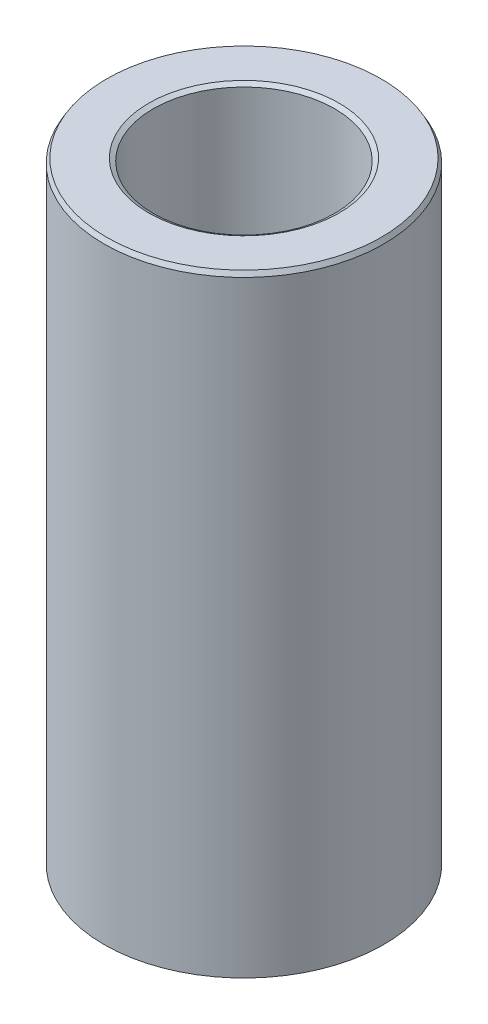
ISO-10303-21;
HEADER;
FILE_DESCRIPTION(('STEP AP214'),'2;1');
FILE_NAME('part.step','',(''),(''),'','','');
FILE_SCHEMA(('AUTOMOTIVE_DESIGN { 1 0 10303 214 1 1 1 1 }'));
ENDSEC;
DATA;
#1=APPLICATION_CONTEXT('core data for automotive mechanical design processes');
#2=APPLICATION_PROTOCOL_DEFINITION('international standard','automotive_design',2000,#1);
#3=PRODUCT_CONTEXT('',#1,'mechanical');
#4=PRODUCT('Part','Part','',(#3));
#5=PRODUCT_RELATED_PRODUCT_CATEGORY('part','',(#4));
#6=PRODUCT_DEFINITION_FORMATION('','',#4);
#7=PRODUCT_DEFINITION_CONTEXT('part definition',#1,'design');
#8=PRODUCT_DEFINITION('design','',#6,#7);
#9=PRODUCT_DEFINITION_SHAPE('','',#8);
#10=(LENGTH_UNIT() NAMED_UNIT(*) SI_UNIT(.MILLI.,.METRE.));
#11=(NAMED_UNIT(*) PLANE_ANGLE_UNIT() SI_UNIT($,.RADIAN.));
#12=(NAMED_UNIT(*) SI_UNIT($,.STERADIAN.) SOLID_ANGLE_UNIT());
#13=UNCERTAINTY_MEASURE_WITH_UNIT(LENGTH_MEASURE(1.E-05),#10,'distance_accuracy_value','');
#14=(GEOMETRIC_REPRESENTATION_CONTEXT(3) GLOBAL_UNCERTAINTY_ASSIGNED_CONTEXT((#13)) GLOBAL_UNIT_ASSIGNED_CONTEXT((#10,
#11,#12)) REPRESENTATION_CONTEXT('',''));
#15=CARTESIAN_POINT('',(0.,0.,0.));
#16=DIRECTION('',(0.,0.,1.));
#17=DIRECTION('',(1.,0.,0.));
#18=AXIS2_PLACEMENT_3D('',#15,#16,#17);
#19=CARTESIAN_POINT('',(0.,252.346503880526,0.));
#20=DIRECTION('',(0.,-1.,0.));
#21=DIRECTION('',(0.,0.,-1.));
#22=AXIS2_PLACEMENT_3D('',#19,#20,#21);
#23=CYLINDRICAL_SURFACE('',#22,57.5);
#24=CARTESIAN_POINT('',(0.,1.06429544850678,0.));
#25=DIRECTION('',(0.,1.,0.));
#26=DIRECTION('',(0.,0.,1.));
#27=AXIS2_PLACEMENT_3D('',#24,#25,#26);
#28=CIRCLE('',#27,57.5);
#29=CARTESIAN_POINT('',(0.,1.06429544850678,57.5));
#30=VERTEX_POINT('',#29);
#31=EDGE_CURVE('E10',#30,#30,#28,.T.);
#32=ORIENTED_EDGE('',*,*,#31,.T.);
#33=EDGE_LOOP('',(#32));
#34=FACE_BOUND('',#33,.T.);
#35=CARTESIAN_POINT('',(0.,250.503090089448,0.));
#36=DIRECTION('',(0.,1.,0.));
#37=DIRECTION('',(0.,0.,1.));
#38=AXIS2_PLACEMENT_3D('',#35,#36,#37);
#39=CIRCLE('',#38,57.5);
#40=CARTESIAN_POINT('',(0.,250.503090089448,57.5));
#41=VERTEX_POINT('',#40);
#42=EDGE_CURVE('E50',#41,#41,#39,.F.);
#43=ORIENTED_EDGE('',*,*,#42,.T.);
#44=EDGE_LOOP('',(#43));
#45=FACE_BOUND('',#44,.T.);
#46=ADVANCED_FACE('F39',(#34,#45),#23,.T.);
#47=CARTESIAN_POINT('',(0.,252.346503880526,0.));
#48=DIRECTION('',(0.,1.,0.));
#49=DIRECTION('',(0.,0.,1.));
#50=AXIS2_PLACEMENT_3D('',#47,#48,#49);
#51=PLANE('',#50);
#52=CARTESIAN_POINT('',(0.,252.346503880526,0.));
#53=DIRECTION('',(0.,1.,0.));
#54=DIRECTION('',(0.,0.,1.));
#55=AXIS2_PLACEMENT_3D('',#52,#53,#54);
#56=CIRCLE('',#55,39.1389970354206);
#57=CARTESIAN_POINT('',(0.,252.346503880526,39.1389970354206));
#58=VERTEX_POINT('',#57);
#59=EDGE_CURVE('E58',#58,#58,#56,.F.);
#60=ORIENTED_EDGE('',*,*,#59,.T.);
#61=EDGE_LOOP('',(#60));
#62=FACE_BOUND('',#61,.T.);
#63=CARTESIAN_POINT('',(0.,252.346503880526,0.));
#64=DIRECTION('',(0.,1.,0.));
#65=DIRECTION('',(0.,0.,1.));
#66=AXIS2_PLACEMENT_3D('',#63,#64,#65);
#67=CIRCLE('',#66,56.4357045514932);
#68=CARTESIAN_POINT('',(0.,252.346503880526,56.4357045514932));
#69=VERTEX_POINT('',#68);
#70=EDGE_CURVE('E61',#69,#69,#67,.T.);
#71=ORIENTED_EDGE('',*,*,#70,.T.);
#72=EDGE_LOOP('',(#71));
#73=FACE_BOUND('',#72,.T.);
#74=ADVANCED_FACE('F88',(#62,#73),#51,.T.);
#75=CARTESIAN_POINT('',(0.,0.,0.));
#76=DIRECTION('',(0.,1.,0.));
#77=DIRECTION('',(0.,0.,1.));
#78=AXIS2_PLACEMENT_3D('',#75,#76,#77);
#79=PLANE('',#78);
#80=CARTESIAN_POINT('',(0.,0.,0.));
#81=DIRECTION('',(0.,1.,0.));
#82=DIRECTION('',(0.,0.,1.));
#83=AXIS2_PLACEMENT_3D('',#80,#81,#82);
#84=CIRCLE('',#83,38.3598786928494);
#85=CARTESIAN_POINT('',(0.,0.,38.3598786928494));
#86=VERTEX_POINT('',#85);
#87=EDGE_CURVE('E51',#86,#86,#84,.T.);
#88=ORIENTED_EDGE('',*,*,#87,.T.);
#89=EDGE_LOOP('',(#88));
#90=FACE_BOUND('',#89,.T.);
#91=CARTESIAN_POINT('',(0.,0.,0.));
#92=DIRECTION('',(0.,1.,0.));
#93=DIRECTION('',(0.,0.,1.));
#94=AXIS2_PLACEMENT_3D('',#91,#92,#93);
#95=CIRCLE('',#94,55.656586208922);
#96=CARTESIAN_POINT('',(0.,0.,55.656586208922));
#97=VERTEX_POINT('',#96);
#98=EDGE_CURVE('E54',#97,#97,#95,.F.);
#99=ORIENTED_EDGE('',*,*,#98,.T.);
#100=EDGE_LOOP('',(#99));
#101=FACE_BOUND('',#100,.T.);
#102=ADVANCED_FACE('F83',(#90,#101),#79,.F.);
#103=CARTESIAN_POINT('',(0.,252.346503880526,0.));
#104=DIRECTION('',(0.,-1.,0.));
#105=DIRECTION('',(0.,0.,-1.));
#106=AXIS2_PLACEMENT_3D('',#103,#104,#105);
#107=CYLINDRICAL_SURFACE('',#106,37.2955832443427);
#108=CARTESIAN_POINT('',(0.,251.282208432019,0.));
#109=DIRECTION('',(0.,1.,0.));
#110=DIRECTION('',(0.,0.,1.));
#111=AXIS2_PLACEMENT_3D('',#108,#109,#110);
#112=CIRCLE('',#111,37.2955832443427);
#113=CARTESIAN_POINT('',(0.,251.282208432019,37.2955832443427));
#114=VERTEX_POINT('',#113);
#115=EDGE_CURVE('E67',#114,#114,#112,.T.);
#116=ORIENTED_EDGE('',*,*,#115,.T.);
#117=EDGE_LOOP('',(#116));
#118=FACE_BOUND('',#117,.T.);
#119=CARTESIAN_POINT('',(0.,1.84341379107805,0.));
#120=DIRECTION('',(0.,1.,0.));
#121=DIRECTION('',(0.,0.,1.));
#122=AXIS2_PLACEMENT_3D('',#119,#120,#121);
#123=CIRCLE('',#122,37.2955832443427);
#124=CARTESIAN_POINT('',(0.,1.84341379107805,37.2955832443427));
#125=VERTEX_POINT('',#124);
#126=EDGE_CURVE('E69',#125,#125,#123,.F.);
#127=ORIENTED_EDGE('',*,*,#126,.T.);
#128=EDGE_LOOP('',(#127));
#129=FACE_BOUND('',#128,.T.);
#130=ADVANCED_FACE('F71',(#118,#129),#107,.F.);
#131=CARTESIAN_POINT('',(0.,251.282208432019,0.));
#132=DIRECTION('',(0.,1.,0.));
#133=DIRECTION('',(0.,0.,1.));
#134=AXIS2_PLACEMENT_3D('',#131,#132,#133);
#135=CONICAL_SURFACE('',#134,37.2955832443427,1.04719755119659);
#136=ORIENTED_EDGE('',*,*,#59,.F.);
#137=EDGE_LOOP('',(#136));
#138=FACE_BOUND('',#137,.T.);
#139=ORIENTED_EDGE('',*,*,#115,.F.);
#140=EDGE_LOOP('',(#139));
#141=FACE_BOUND('',#140,.T.);
#142=ADVANCED_FACE('F77',(#138,#141),#135,.F.);
#143=CARTESIAN_POINT('',(0.,0.,0.));
#144=DIRECTION('',(0.,-1.,0.));
#145=DIRECTION('',(0.,0.,-1.));
#146=AXIS2_PLACEMENT_3D('',#143,#144,#145);
#147=CONICAL_SURFACE('',#146,38.3598786928494,0.523598775598287);
#148=ORIENTED_EDGE('',*,*,#126,.F.);
#149=EDGE_LOOP('',(#148));
#150=FACE_BOUND('',#149,.T.);
#151=ORIENTED_EDGE('',*,*,#87,.F.);
#152=EDGE_LOOP('',(#151));
#153=FACE_BOUND('',#152,.T.);
#154=ADVANCED_FACE('F73',(#150,#153),#147,.F.);
#155=CARTESIAN_POINT('',(0.,1.06429544850678,0.));
#156=DIRECTION('',(0.,1.,0.));
#157=DIRECTION('',(0.,0.,1.));
#158=AXIS2_PLACEMENT_3D('',#155,#156,#157);
#159=CONICAL_SURFACE('',#158,57.5,1.04719755119659);
#160=ORIENTED_EDGE('',*,*,#98,.F.);
#161=EDGE_LOOP('',(#160));
#162=FACE_BOUND('',#161,.T.);
#163=ORIENTED_EDGE('',*,*,#31,.F.);
#164=EDGE_LOOP('',(#163));
#165=FACE_BOUND('',#164,.T.);
#166=ADVANCED_FACE('F76',(#162,#165),#159,.T.);
#167=CARTESIAN_POINT('',(0.,252.346503880526,0.));
#168=DIRECTION('',(0.,-1.,0.));
#169=DIRECTION('',(0.,0.,-1.));
#170=AXIS2_PLACEMENT_3D('',#167,#168,#169);
#171=CONICAL_SURFACE('',#170,56.4357045514932,0.523598775598303);
#172=ORIENTED_EDGE('',*,*,#42,.F.);
#173=EDGE_LOOP('',(#172));
#174=FACE_BOUND('',#173,.T.);
#175=ORIENTED_EDGE('',*,*,#70,.F.);
#176=EDGE_LOOP('',(#175));
#177=FACE_BOUND('',#176,.T.);
#178=ADVANCED_FACE('F45',(#174,#177),#171,.T.);
#179=CLOSED_SHELL('',(#46,#74,#102,#130,#142,#154,#166,#178));
#180=MANIFOLD_SOLID_BREP('B2',#179);
#181=ADVANCED_BREP_SHAPE_REPRESENTATION('',(#18,#180),#14);
#182=SHAPE_DEFINITION_REPRESENTATION(#9,#181);
ENDSEC;
END-ISO-10303-21;
